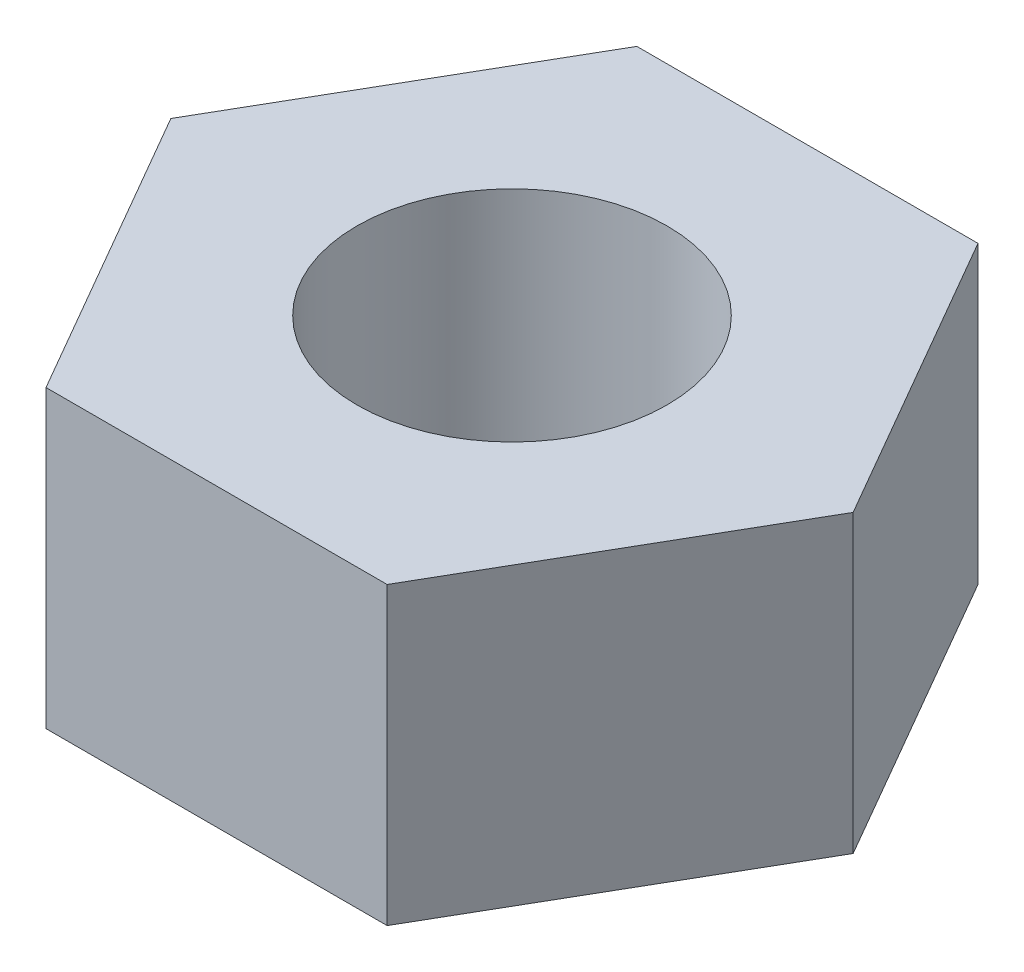
ISO-10303-21;
HEADER;
FILE_DESCRIPTION(('STEP AP214'),'2;1');
FILE_NAME('part.step','',(''),(''),'','','');
FILE_SCHEMA(('AUTOMOTIVE_DESIGN { 1 0 10303 214 1 1 1 1 }'));
ENDSEC;
DATA;
#1=APPLICATION_CONTEXT('core data for automotive mechanical design processes');
#2=APPLICATION_PROTOCOL_DEFINITION('international standard','automotive_design',2000,#1);
#3=PRODUCT_CONTEXT('',#1,'mechanical');
#4=PRODUCT('Part','Part','',(#3));
#5=PRODUCT_RELATED_PRODUCT_CATEGORY('part','',(#4));
#6=PRODUCT_DEFINITION_FORMATION('','',#4);
#7=PRODUCT_DEFINITION_CONTEXT('part definition',#1,'design');
#8=PRODUCT_DEFINITION('design','',#6,#7);
#9=PRODUCT_DEFINITION_SHAPE('','',#8);
#10=(LENGTH_UNIT() NAMED_UNIT(*) SI_UNIT(.MILLI.,.METRE.));
#11=(NAMED_UNIT(*) PLANE_ANGLE_UNIT() SI_UNIT($,.RADIAN.));
#12=(NAMED_UNIT(*) SI_UNIT($,.STERADIAN.) SOLID_ANGLE_UNIT());
#13=UNCERTAINTY_MEASURE_WITH_UNIT(LENGTH_MEASURE(1.E-05),#10,'distance_accuracy_value','');
#14=(GEOMETRIC_REPRESENTATION_CONTEXT(3) GLOBAL_UNCERTAINTY_ASSIGNED_CONTEXT((#13)) GLOBAL_UNIT_ASSIGNED_CONTEXT((#10,
#11,#12)) REPRESENTATION_CONTEXT('',''));
#15=CARTESIAN_POINT('',(0.,0.,0.));
#16=DIRECTION('',(0.,0.,1.));
#17=DIRECTION('',(1.,0.,0.));
#18=AXIS2_PLACEMENT_3D('',#15,#16,#17);
#19=CARTESIAN_POINT('',(-2.3094010767585,4.,-4.));
#20=DIRECTION('',(0.,1.,0.));
#21=DIRECTION('',(0.,0.,1.));
#22=AXIS2_PLACEMENT_3D('',#19,#20,#21);
#23=PLANE('',#22);
#24=DIRECTION('',(-1.,0.,0.));
#25=VECTOR('',#24,1.);
#26=CARTESIAN_POINT('',(2.3094010767585,4.,-4.));
#27=LINE('',#26,#25);
#28=CARTESIAN_POINT('',(2.3094010767585,4.,-4.));
#29=VERTEX_POINT('',#28);
#30=CARTESIAN_POINT('',(-2.3094010767585,4.,-4.));
#31=VERTEX_POINT('',#30);
#32=EDGE_CURVE('E130',#29,#31,#27,.T.);
#33=ORIENTED_EDGE('',*,*,#32,.T.);
#34=DIRECTION('',(-0.5,0.,0.866025403784439));
#35=VECTOR('',#34,1.);
#36=CARTESIAN_POINT('',(-2.3094010767585,4.,-4.));
#37=LINE('',#36,#35);
#38=CARTESIAN_POINT('',(-4.61880215351701,4.,0.));
#39=VERTEX_POINT('',#38);
#40=EDGE_CURVE('E88',#31,#39,#37,.T.);
#41=ORIENTED_EDGE('',*,*,#40,.T.);
#42=DIRECTION('',(0.5,0.,0.866025403784439));
#43=VECTOR('',#42,1.);
#44=CARTESIAN_POINT('',(-4.61880215351701,4.,0.));
#45=LINE('',#44,#43);
#46=CARTESIAN_POINT('',(-2.3094010767585,4.,4.));
#47=VERTEX_POINT('',#46);
#48=EDGE_CURVE('E101',#39,#47,#45,.T.);
#49=ORIENTED_EDGE('',*,*,#48,.T.);
#50=DIRECTION('',(1.,0.,0.));
#51=VECTOR('',#50,1.);
#52=CARTESIAN_POINT('',(-2.3094010767585,4.,4.));
#53=LINE('',#52,#51);
#54=CARTESIAN_POINT('',(2.3094010767585,4.,4.));
#55=VERTEX_POINT('',#54);
#56=EDGE_CURVE('E95',#47,#55,#53,.T.);
#57=ORIENTED_EDGE('',*,*,#56,.T.);
#58=DIRECTION('',(0.5,0.,-0.866025403784438));
#59=VECTOR('',#58,1.);
#60=CARTESIAN_POINT('',(2.3094010767585,4.,4.));
#61=LINE('',#60,#59);
#62=CARTESIAN_POINT('',(4.61880215351701,4.,0.));
#63=VERTEX_POINT('',#62);
#64=EDGE_CURVE('E99',#55,#63,#61,.T.);
#65=ORIENTED_EDGE('',*,*,#64,.T.);
#66=DIRECTION('',(-0.5,0.,-0.866025403784439));
#67=VECTOR('',#66,1.);
#68=CARTESIAN_POINT('',(4.61880215351701,4.,0.));
#69=LINE('',#68,#67);
#70=EDGE_CURVE('E51',#63,#29,#69,.T.);
#71=ORIENTED_EDGE('',*,*,#70,.T.);
#72=EDGE_LOOP('',(#33,#41,#49,#57,#65,#71));
#73=FACE_BOUND('',#72,.T.);
#74=CARTESIAN_POINT('',(0.,4.,0.));
#75=DIRECTION('',(0.,1.,0.));
#76=DIRECTION('',(0.,0.,1.));
#77=AXIS2_PLACEMENT_3D('',#74,#75,#76);
#78=CIRCLE('',#77,2.1);
#79=CARTESIAN_POINT('',(0.,4.,2.1));
#80=VERTEX_POINT('',#79);
#81=EDGE_CURVE('E123',#80,#80,#78,.T.);
#82=ORIENTED_EDGE('',*,*,#81,.F.);
#83=EDGE_LOOP('',(#82));
#84=FACE_BOUND('',#83,.T.);
#85=ADVANCED_FACE('F34',(#73,#84),#23,.T.);
#86=CARTESIAN_POINT('',(-2.3094010767585,0.,-4.));
#87=DIRECTION('',(0.,1.,0.));
#88=DIRECTION('',(0.,0.,1.));
#89=AXIS2_PLACEMENT_3D('',#86,#87,#88);
#90=PLANE('',#89);
#91=DIRECTION('',(-1.,0.,0.));
#92=VECTOR('',#91,1.);
#93=CARTESIAN_POINT('',(2.3094010767585,0.,-4.));
#94=LINE('',#93,#92);
#95=CARTESIAN_POINT('',(2.3094010767585,0.,-4.));
#96=VERTEX_POINT('',#95);
#97=CARTESIAN_POINT('',(-2.3094010767585,0.,-4.));
#98=VERTEX_POINT('',#97);
#99=EDGE_CURVE('E119',#96,#98,#94,.T.);
#100=ORIENTED_EDGE('',*,*,#99,.F.);
#101=DIRECTION('',(-0.5,0.,-0.866025403784439));
#102=VECTOR('',#101,1.);
#103=CARTESIAN_POINT('',(4.61880215351701,0.,0.));
#104=LINE('',#103,#102);
#105=CARTESIAN_POINT('',(4.61880215351701,0.,0.));
#106=VERTEX_POINT('',#105);
#107=EDGE_CURVE('E80',#106,#96,#104,.T.);
#108=ORIENTED_EDGE('',*,*,#107,.F.);
#109=DIRECTION('',(0.5,0.,-0.866025403784438));
#110=VECTOR('',#109,1.);
#111=CARTESIAN_POINT('',(2.3094010767585,0.,4.));
#112=LINE('',#111,#110);
#113=CARTESIAN_POINT('',(2.3094010767585,0.,4.));
#114=VERTEX_POINT('',#113);
#115=EDGE_CURVE('E74',#114,#106,#112,.T.);
#116=ORIENTED_EDGE('',*,*,#115,.F.);
#117=DIRECTION('',(1.,0.,0.));
#118=VECTOR('',#117,1.);
#119=CARTESIAN_POINT('',(-2.3094010767585,0.,4.));
#120=LINE('',#119,#118);
#121=CARTESIAN_POINT('',(-2.3094010767585,0.,4.));
#122=VERTEX_POINT('',#121);
#123=EDGE_CURVE('E109',#122,#114,#120,.T.);
#124=ORIENTED_EDGE('',*,*,#123,.F.);
#125=DIRECTION('',(0.5,0.,0.866025403784439));
#126=VECTOR('',#125,1.);
#127=CARTESIAN_POINT('',(-4.61880215351701,0.,0.));
#128=LINE('',#127,#126);
#129=CARTESIAN_POINT('',(-4.61880215351701,0.,0.));
#130=VERTEX_POINT('',#129);
#131=EDGE_CURVE('E125',#130,#122,#128,.T.);
#132=ORIENTED_EDGE('',*,*,#131,.F.);
#133=DIRECTION('',(-0.5,0.,0.866025403784439));
#134=VECTOR('',#133,1.);
#135=CARTESIAN_POINT('',(-2.3094010767585,0.,-4.));
#136=LINE('',#135,#134);
#137=EDGE_CURVE('E122',#98,#130,#136,.T.);
#138=ORIENTED_EDGE('',*,*,#137,.F.);
#139=EDGE_LOOP('',(#100,#108,#116,#124,#132,#138));
#140=FACE_BOUND('',#139,.T.);
#141=CARTESIAN_POINT('',(0.,0.,0.));
#142=DIRECTION('',(0.,1.,0.));
#143=DIRECTION('',(0.,0.,1.));
#144=AXIS2_PLACEMENT_3D('',#141,#142,#143);
#145=CIRCLE('',#144,2.1);
#146=CARTESIAN_POINT('',(0.,0.,2.1));
#147=VERTEX_POINT('',#146);
#148=EDGE_CURVE('E223',#147,#147,#145,.T.);
#149=ORIENTED_EDGE('',*,*,#148,.T.);
#150=EDGE_LOOP('',(#149));
#151=FACE_BOUND('',#150,.T.);
#152=ADVANCED_FACE('F139',(#140,#151),#90,.F.);
#153=CARTESIAN_POINT('',(2.3094010767585,4.,-4.));
#154=DIRECTION('',(0.,0.,1.));
#155=DIRECTION('',(1.,0.,0.));
#156=AXIS2_PLACEMENT_3D('',#153,#154,#155);
#157=PLANE('',#156);
#158=ORIENTED_EDGE('',*,*,#99,.T.);
#159=DIRECTION('',(0.,-1.,0.));
#160=VECTOR('',#159,1.);
#161=CARTESIAN_POINT('',(-2.3094010767585,4.,-4.));
#162=LINE('',#161,#160);
#163=EDGE_CURVE('E11',#31,#98,#162,.T.);
#164=ORIENTED_EDGE('',*,*,#163,.F.);
#165=ORIENTED_EDGE('',*,*,#32,.F.);
#166=DIRECTION('',(0.,-1.,0.));
#167=VECTOR('',#166,1.);
#168=CARTESIAN_POINT('',(2.3094010767585,4.,-4.));
#169=LINE('',#168,#167);
#170=EDGE_CURVE('E115',#29,#96,#169,.T.);
#171=ORIENTED_EDGE('',*,*,#170,.T.);
#172=EDGE_LOOP('',(#158,#164,#165,#171));
#173=FACE_BOUND('',#172,.T.);
#174=ADVANCED_FACE('F36',(#173),#157,.F.);
#175=CARTESIAN_POINT('',(-2.3094010767585,4.,-4.));
#176=DIRECTION('',(0.866025403784439,0.,0.5));
#177=DIRECTION('',(0.5,0.,-0.866025403784439));
#178=AXIS2_PLACEMENT_3D('',#175,#176,#177);
#179=PLANE('',#178);
#180=ORIENTED_EDGE('',*,*,#137,.T.);
#181=DIRECTION('',(0.,-1.,0.));
#182=VECTOR('',#181,1.);
#183=CARTESIAN_POINT('',(-4.61880215351701,4.,0.));
#184=LINE('',#183,#182);
#185=EDGE_CURVE('E43',#39,#130,#184,.T.);
#186=ORIENTED_EDGE('',*,*,#185,.F.);
#187=ORIENTED_EDGE('',*,*,#40,.F.);
#188=ORIENTED_EDGE('',*,*,#163,.T.);
#189=EDGE_LOOP('',(#180,#186,#187,#188));
#190=FACE_BOUND('',#189,.T.);
#191=ADVANCED_FACE('F164',(#190),#179,.F.);
#192=CARTESIAN_POINT('',(-4.61880215351701,4.,0.));
#193=DIRECTION('',(0.866025403784439,0.,-0.5));
#194=DIRECTION('',(-0.5,0.,-0.866025403784439));
#195=AXIS2_PLACEMENT_3D('',#192,#193,#194);
#196=PLANE('',#195);
#197=ORIENTED_EDGE('',*,*,#131,.T.);
#198=DIRECTION('',(0.,-1.,0.));
#199=VECTOR('',#198,1.);
#200=CARTESIAN_POINT('',(-2.3094010767585,4.,4.));
#201=LINE('',#200,#199);
#202=EDGE_CURVE('E110',#47,#122,#201,.T.);
#203=ORIENTED_EDGE('',*,*,#202,.F.);
#204=ORIENTED_EDGE('',*,*,#48,.F.);
#205=ORIENTED_EDGE('',*,*,#185,.T.);
#206=EDGE_LOOP('',(#197,#203,#204,#205));
#207=FACE_BOUND('',#206,.T.);
#208=ADVANCED_FACE('F136',(#207),#196,.F.);
#209=CARTESIAN_POINT('',(-2.3094010767585,4.,4.));
#210=DIRECTION('',(0.,0.,-1.));
#211=DIRECTION('',(-1.,0.,0.));
#212=AXIS2_PLACEMENT_3D('',#209,#210,#211);
#213=PLANE('',#212);
#214=ORIENTED_EDGE('',*,*,#123,.T.);
#215=DIRECTION('',(0.,-1.,0.));
#216=VECTOR('',#215,1.);
#217=CARTESIAN_POINT('',(2.3094010767585,4.,4.));
#218=LINE('',#217,#216);
#219=EDGE_CURVE('E106',#55,#114,#218,.T.);
#220=ORIENTED_EDGE('',*,*,#219,.F.);
#221=ORIENTED_EDGE('',*,*,#56,.F.);
#222=ORIENTED_EDGE('',*,*,#202,.T.);
#223=EDGE_LOOP('',(#214,#220,#221,#222));
#224=FACE_BOUND('',#223,.T.);
#225=ADVANCED_FACE('F107',(#224),#213,.F.);
#226=CARTESIAN_POINT('',(2.3094010767585,4.,4.));
#227=DIRECTION('',(-0.866025403784439,0.,-0.5));
#228=DIRECTION('',(-0.5,0.,0.866025403784438));
#229=AXIS2_PLACEMENT_3D('',#226,#227,#228);
#230=PLANE('',#229);
#231=ORIENTED_EDGE('',*,*,#115,.T.);
#232=DIRECTION('',(0.,-1.,0.));
#233=VECTOR('',#232,1.);
#234=CARTESIAN_POINT('',(4.61880215351701,4.,0.));
#235=LINE('',#234,#233);
#236=EDGE_CURVE('E111',#63,#106,#235,.T.);
#237=ORIENTED_EDGE('',*,*,#236,.F.);
#238=ORIENTED_EDGE('',*,*,#64,.F.);
#239=ORIENTED_EDGE('',*,*,#219,.T.);
#240=EDGE_LOOP('',(#231,#237,#238,#239));
#241=FACE_BOUND('',#240,.T.);
#242=ADVANCED_FACE('F113',(#241),#230,.F.);
#243=CARTESIAN_POINT('',(4.61880215351701,4.,0.));
#244=DIRECTION('',(-0.866025403784439,0.,0.5));
#245=DIRECTION('',(0.5,0.,0.866025403784439));
#246=AXIS2_PLACEMENT_3D('',#243,#244,#245);
#247=PLANE('',#246);
#248=ORIENTED_EDGE('',*,*,#107,.T.);
#249=ORIENTED_EDGE('',*,*,#170,.F.);
#250=ORIENTED_EDGE('',*,*,#70,.F.);
#251=ORIENTED_EDGE('',*,*,#236,.T.);
#252=EDGE_LOOP('',(#248,#249,#250,#251));
#253=FACE_BOUND('',#252,.T.);
#254=ADVANCED_FACE('F144',(#253),#247,.F.);
#255=CARTESIAN_POINT('',(0.,4.,0.));
#256=DIRECTION('',(0.,-1.,0.));
#257=DIRECTION('',(0.,0.,-1.));
#258=AXIS2_PLACEMENT_3D('',#255,#256,#257);
#259=CYLINDRICAL_SURFACE('',#258,2.1);
#260=ORIENTED_EDGE('',*,*,#81,.T.);
#261=EDGE_LOOP('',(#260));
#262=FACE_BOUND('',#261,.T.);
#263=ORIENTED_EDGE('',*,*,#148,.F.);
#264=EDGE_LOOP('',(#263));
#265=FACE_BOUND('',#264,.T.);
#266=ADVANCED_FACE('F146',(#262,#265),#259,.F.);
#267=CLOSED_SHELL('',(#85,#152,#174,#191,#208,#225,#242,#254,#266));
#268=MANIFOLD_SOLID_BREP('B2',#267);
#269=ADVANCED_BREP_SHAPE_REPRESENTATION('',(#18,#268),#14);
#270=SHAPE_DEFINITION_REPRESENTATION(#9,#269);
ENDSEC;
END-ISO-10303-21;
